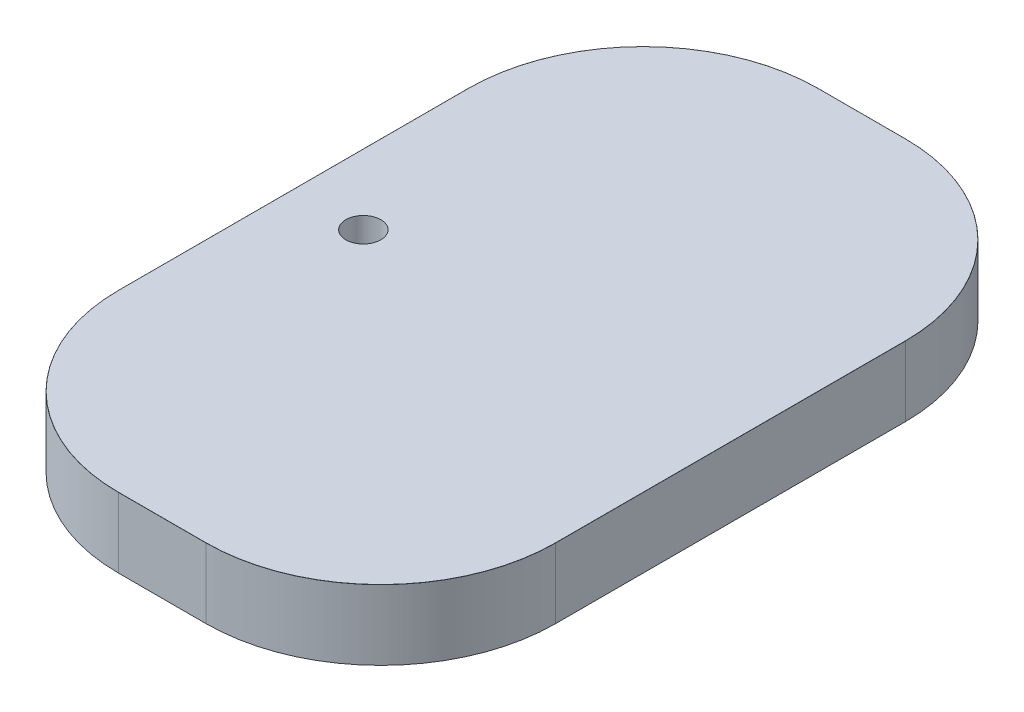
ISO-10303-21;
HEADER;
FILE_DESCRIPTION(('STEP AP214'),'2;1');
FILE_NAME('part.step','',(''),(''),'','','');
FILE_SCHEMA(('AUTOMOTIVE_DESIGN { 1 0 10303 214 1 1 1 1 }'));
ENDSEC;
DATA;
#1=APPLICATION_CONTEXT('core data for automotive mechanical design processes');
#2=APPLICATION_PROTOCOL_DEFINITION('international standard','automotive_design',2000,#1);
#3=PRODUCT_CONTEXT('',#1,'mechanical');
#4=PRODUCT('Part','Part','',(#3));
#5=PRODUCT_RELATED_PRODUCT_CATEGORY('part','',(#4));
#6=PRODUCT_DEFINITION_FORMATION('','',#4);
#7=PRODUCT_DEFINITION_CONTEXT('part definition',#1,'design');
#8=PRODUCT_DEFINITION('design','',#6,#7);
#9=PRODUCT_DEFINITION_SHAPE('','',#8);
#10=(LENGTH_UNIT() NAMED_UNIT(*) SI_UNIT(.MILLI.,.METRE.));
#11=(NAMED_UNIT(*) PLANE_ANGLE_UNIT() SI_UNIT($,.RADIAN.));
#12=(NAMED_UNIT(*) SI_UNIT($,.STERADIAN.) SOLID_ANGLE_UNIT());
#13=UNCERTAINTY_MEASURE_WITH_UNIT(LENGTH_MEASURE(1.E-05),#10,'distance_accuracy_value','');
#14=(GEOMETRIC_REPRESENTATION_CONTEXT(3) GLOBAL_UNCERTAINTY_ASSIGNED_CONTEXT((#13)) GLOBAL_UNIT_ASSIGNED_CONTEXT((#10,
#11,#12)) REPRESENTATION_CONTEXT('',''));
#15=CARTESIAN_POINT('',(0.,0.,0.));
#16=DIRECTION('',(0.,0.,1.));
#17=DIRECTION('',(1.,0.,0.));
#18=AXIS2_PLACEMENT_3D('',#15,#16,#17);
#19=CARTESIAN_POINT('',(-5.,8.,-20.));
#20=DIRECTION('',(0.,-1.,0.));
#21=DIRECTION('',(0.,0.,-1.));
#22=AXIS2_PLACEMENT_3D('',#19,#20,#21);
#23=CYLINDRICAL_SURFACE('',#22,20.);
#24=DIRECTION('',(0.,-1.,0.));
#25=VECTOR('',#24,1.);
#26=CARTESIAN_POINT('',(-25.,8.,-20.));
#27=LINE('',#26,#25);
#28=CARTESIAN_POINT('',(-25.,7.99,-20.));
#29=VERTEX_POINT('',#28);
#30=CARTESIAN_POINT('',(-25.,0.,-20.));
#31=VERTEX_POINT('',#30);
#32=EDGE_CURVE('E138',#29,#31,#27,.T.);
#33=ORIENTED_EDGE('',*,*,#32,.F.);
#34=CARTESIAN_POINT('',(-5.,7.99,-20.));
#35=DIRECTION('',(0.,-1.,0.));
#36=DIRECTION('',(0.,0.,-1.));
#37=AXIS2_PLACEMENT_3D('',#34,#35,#36);
#38=CIRCLE('',#37,20.);
#39=CARTESIAN_POINT('',(-5.,7.99,-40.));
#40=VERTEX_POINT('',#39);
#41=EDGE_CURVE('E239',#29,#40,#38,.T.);
#42=ORIENTED_EDGE('',*,*,#41,.T.);
#43=DIRECTION('',(0.,-1.,0.));
#44=VECTOR('',#43,1.);
#45=CARTESIAN_POINT('',(-5.,8.,-40.));
#46=LINE('',#45,#44);
#47=CARTESIAN_POINT('',(-5.,0.,-40.));
#48=VERTEX_POINT('',#47);
#49=EDGE_CURVE('E163',#40,#48,#46,.T.);
#50=ORIENTED_EDGE('',*,*,#49,.T.);
#51=CARTESIAN_POINT('',(-5.,0.,-20.));
#52=DIRECTION('',(0.,1.,0.));
#53=DIRECTION('',(0.,0.,-1.));
#54=AXIS2_PLACEMENT_3D('',#51,#52,#53);
#55=CIRCLE('',#54,20.);
#56=EDGE_CURVE('E156',#48,#31,#55,.T.);
#57=ORIENTED_EDGE('',*,*,#56,.T.);
#58=EDGE_LOOP('',(#33,#42,#50,#57));
#59=FACE_BOUND('',#58,.T.);
#60=ADVANCED_FACE('F47',(#59),#23,.T.);
#61=CARTESIAN_POINT('',(-25.,8.,20.));
#62=DIRECTION('',(1.,0.,0.));
#63=DIRECTION('',(0.,0.,-1.));
#64=AXIS2_PLACEMENT_3D('',#61,#62,#63);
#65=PLANE('',#64);
#66=DIRECTION('',(0.,-1.,0.));
#67=VECTOR('',#66,1.);
#68=CARTESIAN_POINT('',(-25.,8.,20.));
#69=LINE('',#68,#67);
#70=CARTESIAN_POINT('',(-25.,7.99,20.));
#71=VERTEX_POINT('',#70);
#72=CARTESIAN_POINT('',(-25.,0.,20.));
#73=VERTEX_POINT('',#72);
#74=EDGE_CURVE('E150',#71,#73,#69,.T.);
#75=ORIENTED_EDGE('',*,*,#74,.F.);
#76=DIRECTION('',(0.,0.,1.));
#77=VECTOR('',#76,1.);
#78=CARTESIAN_POINT('',(-25.,7.99,20.));
#79=LINE('',#78,#77);
#80=EDGE_CURVE('E11',#71,#29,#79,.F.);
#81=ORIENTED_EDGE('',*,*,#80,.T.);
#82=ORIENTED_EDGE('',*,*,#32,.T.);
#83=DIRECTION('',(0.,0.,1.));
#84=VECTOR('',#83,1.);
#85=CARTESIAN_POINT('',(-25.,0.,20.));
#86=LINE('',#85,#84);
#87=EDGE_CURVE('E141',#31,#73,#86,.T.);
#88=ORIENTED_EDGE('',*,*,#87,.T.);
#89=EDGE_LOOP('',(#75,#81,#82,#88));
#90=FACE_BOUND('',#89,.T.);
#91=ADVANCED_FACE('F140',(#90),#65,.F.);
#92=CARTESIAN_POINT('',(-5.,8.,20.));
#93=DIRECTION('',(0.,-1.,0.));
#94=DIRECTION('',(0.,0.,-1.));
#95=AXIS2_PLACEMENT_3D('',#92,#93,#94);
#96=CYLINDRICAL_SURFACE('',#95,20.);
#97=DIRECTION('',(0.,-1.,0.));
#98=VECTOR('',#97,1.);
#99=CARTESIAN_POINT('',(-5.,8.,40.));
#100=LINE('',#99,#98);
#101=CARTESIAN_POINT('',(-5.,7.99,40.));
#102=VERTEX_POINT('',#101);
#103=CARTESIAN_POINT('',(-5.,0.,40.));
#104=VERTEX_POINT('',#103);
#105=EDGE_CURVE('E210',#102,#104,#100,.T.);
#106=ORIENTED_EDGE('',*,*,#105,.F.);
#107=CARTESIAN_POINT('',(-5.,7.99,20.));
#108=DIRECTION('',(0.,-1.,0.));
#109=DIRECTION('',(0.,0.,-1.));
#110=AXIS2_PLACEMENT_3D('',#107,#108,#109);
#111=CIRCLE('',#110,20.);
#112=EDGE_CURVE('E57',#102,#71,#111,.T.);
#113=ORIENTED_EDGE('',*,*,#112,.T.);
#114=ORIENTED_EDGE('',*,*,#74,.T.);
#115=CARTESIAN_POINT('',(-5.,0.,20.));
#116=DIRECTION('',(0.,1.,0.));
#117=DIRECTION('',(0.,0.,-1.));
#118=AXIS2_PLACEMENT_3D('',#115,#116,#117);
#119=CIRCLE('',#118,20.);
#120=EDGE_CURVE('E159',#73,#104,#119,.T.);
#121=ORIENTED_EDGE('',*,*,#120,.T.);
#122=EDGE_LOOP('',(#106,#113,#114,#121));
#123=FACE_BOUND('',#122,.T.);
#124=ADVANCED_FACE('F326',(#123),#96,.T.);
#125=CARTESIAN_POINT('',(-5.,8.,40.));
#126=DIRECTION('',(0.,0.,-1.));
#127=DIRECTION('',(-1.,0.,0.));
#128=AXIS2_PLACEMENT_3D('',#125,#126,#127);
#129=PLANE('',#128);
#130=DIRECTION('',(0.,-1.,0.));
#131=VECTOR('',#130,1.);
#132=CARTESIAN_POINT('',(5.,8.,40.));
#133=LINE('',#132,#131);
#134=CARTESIAN_POINT('',(5.,7.99,40.));
#135=VERTEX_POINT('',#134);
#136=CARTESIAN_POINT('',(5.,0.,40.));
#137=VERTEX_POINT('',#136);
#138=EDGE_CURVE('E207',#135,#137,#133,.T.);
#139=ORIENTED_EDGE('',*,*,#138,.F.);
#140=DIRECTION('',(1.,0.,0.));
#141=VECTOR('',#140,1.);
#142=CARTESIAN_POINT('',(-5.,7.99,40.));
#143=LINE('',#142,#141);
#144=EDGE_CURVE('E72',#135,#102,#143,.F.);
#145=ORIENTED_EDGE('',*,*,#144,.T.);
#146=ORIENTED_EDGE('',*,*,#105,.T.);
#147=DIRECTION('',(1.,0.,0.));
#148=VECTOR('',#147,1.);
#149=CARTESIAN_POINT('',(-5.,0.,40.));
#150=LINE('',#149,#148);
#151=EDGE_CURVE('E177',#104,#137,#150,.T.);
#152=ORIENTED_EDGE('',*,*,#151,.T.);
#153=EDGE_LOOP('',(#139,#145,#146,#152));
#154=FACE_BOUND('',#153,.T.);
#155=ADVANCED_FACE('F325',(#154),#129,.F.);
#156=CARTESIAN_POINT('',(5.,8.,20.));
#157=DIRECTION('',(0.,-1.,0.));
#158=DIRECTION('',(0.,0.,-1.));
#159=AXIS2_PLACEMENT_3D('',#156,#157,#158);
#160=CYLINDRICAL_SURFACE('',#159,20.);
#161=DIRECTION('',(0.,-1.,0.));
#162=VECTOR('',#161,1.);
#163=CARTESIAN_POINT('',(25.,8.,20.));
#164=LINE('',#163,#162);
#165=CARTESIAN_POINT('',(25.,7.99,20.));
#166=VERTEX_POINT('',#165);
#167=CARTESIAN_POINT('',(25.,0.,20.));
#168=VERTEX_POINT('',#167);
#169=EDGE_CURVE('E204',#166,#168,#164,.T.);
#170=ORIENTED_EDGE('',*,*,#169,.F.);
#171=CARTESIAN_POINT('',(5.,7.99,20.));
#172=DIRECTION('',(0.,-1.,0.));
#173=DIRECTION('',(0.,0.,-1.));
#174=AXIS2_PLACEMENT_3D('',#171,#172,#173);
#175=CIRCLE('',#174,20.);
#176=EDGE_CURVE('E251',#166,#135,#175,.T.);
#177=ORIENTED_EDGE('',*,*,#176,.T.);
#178=ORIENTED_EDGE('',*,*,#138,.T.);
#179=CARTESIAN_POINT('',(5.,0.,20.));
#180=DIRECTION('',(0.,1.,0.));
#181=DIRECTION('',(0.,0.,-1.));
#182=AXIS2_PLACEMENT_3D('',#179,#180,#181);
#183=CIRCLE('',#182,20.);
#184=EDGE_CURVE('E181',#137,#168,#183,.T.);
#185=ORIENTED_EDGE('',*,*,#184,.T.);
#186=EDGE_LOOP('',(#170,#177,#178,#185));
#187=FACE_BOUND('',#186,.T.);
#188=ADVANCED_FACE('F324',(#187),#160,.T.);
#189=CARTESIAN_POINT('',(25.,8.,-20.));
#190=DIRECTION('',(-1.,0.,0.));
#191=DIRECTION('',(0.,0.,1.));
#192=AXIS2_PLACEMENT_3D('',#189,#190,#191);
#193=PLANE('',#192);
#194=DIRECTION('',(0.,-1.,0.));
#195=VECTOR('',#194,1.);
#196=CARTESIAN_POINT('',(25.,8.,-20.));
#197=LINE('',#196,#195);
#198=CARTESIAN_POINT('',(25.,7.99,-20.));
#199=VERTEX_POINT('',#198);
#200=CARTESIAN_POINT('',(25.,0.,-20.));
#201=VERTEX_POINT('',#200);
#202=EDGE_CURVE('E201',#199,#201,#197,.T.);
#203=ORIENTED_EDGE('',*,*,#202,.F.);
#204=DIRECTION('',(0.,0.,-1.));
#205=VECTOR('',#204,1.);
#206=CARTESIAN_POINT('',(25.,7.99,-20.));
#207=LINE('',#206,#205);
#208=EDGE_CURVE('E248',#199,#166,#207,.F.);
#209=ORIENTED_EDGE('',*,*,#208,.T.);
#210=ORIENTED_EDGE('',*,*,#169,.T.);
#211=DIRECTION('',(0.,0.,-1.));
#212=VECTOR('',#211,1.);
#213=CARTESIAN_POINT('',(25.,0.,-20.));
#214=LINE('',#213,#212);
#215=EDGE_CURVE('E185',#168,#201,#214,.T.);
#216=ORIENTED_EDGE('',*,*,#215,.T.);
#217=EDGE_LOOP('',(#203,#209,#210,#216));
#218=FACE_BOUND('',#217,.T.);
#219=ADVANCED_FACE('F321',(#218),#193,.F.);
#220=CARTESIAN_POINT('',(5.,8.,-20.));
#221=DIRECTION('',(0.,-1.,0.));
#222=DIRECTION('',(0.,0.,-1.));
#223=AXIS2_PLACEMENT_3D('',#220,#221,#222);
#224=CYLINDRICAL_SURFACE('',#223,20.);
#225=DIRECTION('',(0.,-1.,0.));
#226=VECTOR('',#225,1.);
#227=CARTESIAN_POINT('',(5.,8.,-40.));
#228=LINE('',#227,#226);
#229=CARTESIAN_POINT('',(5.,7.99,-40.));
#230=VERTEX_POINT('',#229);
#231=CARTESIAN_POINT('',(5.,0.,-40.));
#232=VERTEX_POINT('',#231);
#233=EDGE_CURVE('E198',#230,#232,#228,.T.);
#234=ORIENTED_EDGE('',*,*,#233,.F.);
#235=CARTESIAN_POINT('',(5.,7.99,-20.));
#236=DIRECTION('',(0.,-1.,0.));
#237=DIRECTION('',(0.,0.,-1.));
#238=AXIS2_PLACEMENT_3D('',#235,#236,#237);
#239=CIRCLE('',#238,20.);
#240=EDGE_CURVE('E245',#230,#199,#239,.T.);
#241=ORIENTED_EDGE('',*,*,#240,.T.);
#242=ORIENTED_EDGE('',*,*,#202,.T.);
#243=CARTESIAN_POINT('',(5.,0.,-20.));
#244=DIRECTION('',(0.,1.,0.));
#245=DIRECTION('',(0.,0.,-1.));
#246=AXIS2_PLACEMENT_3D('',#243,#244,#245);
#247=CIRCLE('',#246,20.);
#248=EDGE_CURVE('E189',#201,#232,#247,.T.);
#249=ORIENTED_EDGE('',*,*,#248,.T.);
#250=EDGE_LOOP('',(#234,#241,#242,#249));
#251=FACE_BOUND('',#250,.T.);
#252=ADVANCED_FACE('F316',(#251),#224,.T.);
#253=CARTESIAN_POINT('',(-5.,8.,-40.));
#254=DIRECTION('',(0.,0.,1.));
#255=DIRECTION('',(1.,0.,0.));
#256=AXIS2_PLACEMENT_3D('',#253,#254,#255);
#257=PLANE('',#256);
#258=ORIENTED_EDGE('',*,*,#49,.F.);
#259=DIRECTION('',(-1.,0.,0.));
#260=VECTOR('',#259,1.);
#261=CARTESIAN_POINT('',(-5.,7.99,-40.));
#262=LINE('',#261,#260);
#263=EDGE_CURVE('E242',#40,#230,#262,.F.);
#264=ORIENTED_EDGE('',*,*,#263,.T.);
#265=ORIENTED_EDGE('',*,*,#233,.T.);
#266=DIRECTION('',(-1.,0.,0.));
#267=VECTOR('',#266,1.);
#268=CARTESIAN_POINT('',(-5.,0.,-40.));
#269=LINE('',#268,#267);
#270=EDGE_CURVE('E193',#232,#48,#269,.T.);
#271=ORIENTED_EDGE('',*,*,#270,.T.);
#272=EDGE_LOOP('',(#258,#264,#265,#271));
#273=FACE_BOUND('',#272,.T.);
#274=ADVANCED_FACE('F310',(#273),#257,.F.);
#275=CARTESIAN_POINT('',(-5.,8.,-20.));
#276=DIRECTION('',(0.,-1.,0.));
#277=DIRECTION('',(0.,0.,-1.));
#278=AXIS2_PLACEMENT_3D('',#275,#276,#277);
#279=PLANE('',#278);
#280=CARTESIAN_POINT('',(-17.,8.,0.));
#281=DIRECTION('',(0.,1.,0.));
#282=DIRECTION('',(0.,0.,1.));
#283=AXIS2_PLACEMENT_3D('',#280,#281,#282);
#284=CIRCLE('',#283,2.);
#285=CARTESIAN_POINT('',(-17.,8.,2.));
#286=VERTEX_POINT('',#285);
#287=EDGE_CURVE('E172',#286,#286,#284,.T.);
#288=ORIENTED_EDGE('',*,*,#287,.F.);
#289=EDGE_LOOP('',(#288));
#290=FACE_BOUND('',#289,.T.);
#291=DIRECTION('',(-1.,0.,0.));
#292=VECTOR('',#291,1.);
#293=CARTESIAN_POINT('',(-5.,8.,-39.99));
#294=LINE('',#293,#292);
#295=CARTESIAN_POINT('',(5.,8.,-39.99));
#296=VERTEX_POINT('',#295);
#297=CARTESIAN_POINT('',(-5.,8.,-39.99));
#298=VERTEX_POINT('',#297);
#299=EDGE_CURVE('E232',#296,#298,#294,.T.);
#300=ORIENTED_EDGE('',*,*,#299,.T.);
#301=CARTESIAN_POINT('',(-5.,8.,-20.));
#302=DIRECTION('',(0.,-1.,0.));
#303=DIRECTION('',(0.,0.,-1.));
#304=AXIS2_PLACEMENT_3D('',#301,#302,#303);
#305=CIRCLE('',#304,19.99);
#306=CARTESIAN_POINT('',(-24.99,8.,-20.));
#307=VERTEX_POINT('',#306);
#308=EDGE_CURVE('E235',#298,#307,#305,.F.);
#309=ORIENTED_EDGE('',*,*,#308,.T.);
#310=DIRECTION('',(0.,0.,1.));
#311=VECTOR('',#310,1.);
#312=CARTESIAN_POINT('',(-24.99,8.,-20.));
#313=LINE('',#312,#311);
#314=CARTESIAN_POINT('',(-24.99,8.,20.));
#315=VERTEX_POINT('',#314);
#316=EDGE_CURVE('E149',#307,#315,#313,.T.);
#317=ORIENTED_EDGE('',*,*,#316,.T.);
#318=CARTESIAN_POINT('',(-5.,8.,20.));
#319=DIRECTION('',(0.,-1.,0.));
#320=DIRECTION('',(0.,0.,-1.));
#321=AXIS2_PLACEMENT_3D('',#318,#319,#320);
#322=CIRCLE('',#321,19.99);
#323=CARTESIAN_POINT('',(-5.,8.,39.99));
#324=VERTEX_POINT('',#323);
#325=EDGE_CURVE('E217',#315,#324,#322,.F.);
#326=ORIENTED_EDGE('',*,*,#325,.T.);
#327=DIRECTION('',(1.,0.,0.));
#328=VECTOR('',#327,1.);
#329=CARTESIAN_POINT('',(-5.,8.,39.99));
#330=LINE('',#329,#328);
#331=CARTESIAN_POINT('',(5.,8.,39.99));
#332=VERTEX_POINT('',#331);
#333=EDGE_CURVE('E220',#324,#332,#330,.T.);
#334=ORIENTED_EDGE('',*,*,#333,.T.);
#335=CARTESIAN_POINT('',(5.,8.,20.));
#336=DIRECTION('',(0.,-1.,0.));
#337=DIRECTION('',(0.,0.,-1.));
#338=AXIS2_PLACEMENT_3D('',#335,#336,#337);
#339=CIRCLE('',#338,19.99);
#340=CARTESIAN_POINT('',(24.99,8.,20.));
#341=VERTEX_POINT('',#340);
#342=EDGE_CURVE('E223',#332,#341,#339,.F.);
#343=ORIENTED_EDGE('',*,*,#342,.T.);
#344=DIRECTION('',(0.,0.,-1.));
#345=VECTOR('',#344,1.);
#346=CARTESIAN_POINT('',(24.99,8.,-20.));
#347=LINE('',#346,#345);
#348=CARTESIAN_POINT('',(24.99,8.,-20.));
#349=VERTEX_POINT('',#348);
#350=EDGE_CURVE('E226',#341,#349,#347,.T.);
#351=ORIENTED_EDGE('',*,*,#350,.T.);
#352=CARTESIAN_POINT('',(5.,8.,-20.));
#353=DIRECTION('',(0.,-1.,0.));
#354=DIRECTION('',(0.,0.,-1.));
#355=AXIS2_PLACEMENT_3D('',#352,#353,#354);
#356=CIRCLE('',#355,19.99);
#357=EDGE_CURVE('E229',#349,#296,#356,.F.);
#358=ORIENTED_EDGE('',*,*,#357,.T.);
#359=EDGE_LOOP('',(#300,#309,#317,#326,#334,#343,#351,#358));
#360=FACE_BOUND('',#359,.T.);
#361=ADVANCED_FACE('F294',(#290,#360),#279,.F.);
#362=CARTESIAN_POINT('',(-5.,0.,-20.));
#363=DIRECTION('',(0.,-1.,0.));
#364=DIRECTION('',(0.,0.,-1.));
#365=AXIS2_PLACEMENT_3D('',#362,#363,#364);
#366=PLANE('',#365);
#367=CARTESIAN_POINT('',(-17.,0.,0.));
#368=DIRECTION('',(0.,-1.,0.));
#369=DIRECTION('',(0.,0.,-1.));
#370=AXIS2_PLACEMENT_3D('',#367,#368,#369);
#371=CIRCLE('',#370,1.25);
#372=CARTESIAN_POINT('',(-17.,0.,-1.25));
#373=VERTEX_POINT('',#372);
#374=EDGE_CURVE('E492',#373,#373,#371,.T.);
#375=ORIENTED_EDGE('',*,*,#374,.F.);
#376=EDGE_LOOP('',(#375));
#377=FACE_BOUND('',#376,.T.);
#378=ORIENTED_EDGE('',*,*,#56,.F.);
#379=ORIENTED_EDGE('',*,*,#270,.F.);
#380=ORIENTED_EDGE('',*,*,#248,.F.);
#381=ORIENTED_EDGE('',*,*,#215,.F.);
#382=ORIENTED_EDGE('',*,*,#184,.F.);
#383=ORIENTED_EDGE('',*,*,#151,.F.);
#384=ORIENTED_EDGE('',*,*,#120,.F.);
#385=ORIENTED_EDGE('',*,*,#87,.F.);
#386=EDGE_LOOP('',(#378,#379,#380,#381,#382,#383,#384,#385));
#387=FACE_BOUND('',#386,.T.);
#388=ADVANCED_FACE('F154',(#377,#387),#366,.T.);
#389=CARTESIAN_POINT('',(5.,7.99,20.));
#390=DIRECTION('',(0.,-1.,0.));
#391=DIRECTION('',(0.,0.,-1.));
#392=AXIS2_PLACEMENT_3D('',#389,#390,#391);
#393=TOROIDAL_SURFACE('',#392,19.99,0.01);
#394=CARTESIAN_POINT('',(5.,7.99,39.99));
#395=DIRECTION('',(-1.,0.,0.));
#396=DIRECTION('',(0.,0.,1.));
#397=AXIS2_PLACEMENT_3D('',#394,#395,#396);
#398=CIRCLE('',#397,0.01);
#399=EDGE_CURVE('E170',#135,#332,#398,.T.);
#400=ORIENTED_EDGE('',*,*,#399,.F.);
#401=ORIENTED_EDGE('',*,*,#176,.F.);
#402=CARTESIAN_POINT('',(24.99,7.99,20.));
#403=DIRECTION('',(0.,0.,-1.));
#404=DIRECTION('',(-1.,0.,0.));
#405=AXIS2_PLACEMENT_3D('',#402,#403,#404);
#406=CIRCLE('',#405,0.01);
#407=EDGE_CURVE('E166',#341,#166,#406,.T.);
#408=ORIENTED_EDGE('',*,*,#407,.F.);
#409=ORIENTED_EDGE('',*,*,#342,.F.);
#410=EDGE_LOOP('',(#400,#401,#408,#409));
#411=FACE_BOUND('',#410,.T.);
#412=ADVANCED_FACE('F49',(#411),#393,.T.);
#413=CARTESIAN_POINT('',(24.99,7.99,-20.));
#414=DIRECTION('',(0.,0.,-1.));
#415=DIRECTION('',(-1.,0.,0.));
#416=AXIS2_PLACEMENT_3D('',#413,#414,#415);
#417=CYLINDRICAL_SURFACE('',#416,0.01);
#418=ORIENTED_EDGE('',*,*,#407,.T.);
#419=ORIENTED_EDGE('',*,*,#208,.F.);
#420=CARTESIAN_POINT('',(24.99,7.99,-20.));
#421=DIRECTION('',(0.,0.,-1.));
#422=DIRECTION('',(-1.,0.,0.));
#423=AXIS2_PLACEMENT_3D('',#420,#421,#422);
#424=CIRCLE('',#423,0.01);
#425=EDGE_CURVE('E277',#349,#199,#424,.T.);
#426=ORIENTED_EDGE('',*,*,#425,.F.);
#427=ORIENTED_EDGE('',*,*,#350,.F.);
#428=EDGE_LOOP('',(#418,#419,#426,#427));
#429=FACE_BOUND('',#428,.T.);
#430=ADVANCED_FACE('F356',(#429),#417,.T.);
#431=CARTESIAN_POINT('',(-5.,7.99,39.99));
#432=DIRECTION('',(1.,0.,0.));
#433=DIRECTION('',(0.,0.,-1.));
#434=AXIS2_PLACEMENT_3D('',#431,#432,#433);
#435=CYLINDRICAL_SURFACE('',#434,0.01);
#436=ORIENTED_EDGE('',*,*,#399,.T.);
#437=ORIENTED_EDGE('',*,*,#333,.F.);
#438=CARTESIAN_POINT('',(-5.,7.99,39.99));
#439=DIRECTION('',(-1.,0.,0.));
#440=DIRECTION('',(0.,0.,1.));
#441=AXIS2_PLACEMENT_3D('',#438,#439,#440);
#442=CIRCLE('',#441,0.01);
#443=EDGE_CURVE('E273',#102,#324,#442,.T.);
#444=ORIENTED_EDGE('',*,*,#443,.F.);
#445=ORIENTED_EDGE('',*,*,#144,.F.);
#446=EDGE_LOOP('',(#436,#437,#444,#445));
#447=FACE_BOUND('',#446,.T.);
#448=ADVANCED_FACE('F286',(#447),#435,.T.);
#449=CARTESIAN_POINT('',(5.,7.99,-20.));
#450=DIRECTION('',(0.,-1.,0.));
#451=DIRECTION('',(0.,0.,-1.));
#452=AXIS2_PLACEMENT_3D('',#449,#450,#451);
#453=TOROIDAL_SURFACE('',#452,19.99,0.01);
#454=ORIENTED_EDGE('',*,*,#425,.T.);
#455=ORIENTED_EDGE('',*,*,#240,.F.);
#456=CARTESIAN_POINT('',(5.,7.99,-39.99));
#457=DIRECTION('',(-1.,0.,0.));
#458=DIRECTION('',(0.,0.,1.));
#459=AXIS2_PLACEMENT_3D('',#456,#457,#458);
#460=CIRCLE('',#459,0.01);
#461=EDGE_CURVE('E269',#296,#230,#460,.T.);
#462=ORIENTED_EDGE('',*,*,#461,.F.);
#463=ORIENTED_EDGE('',*,*,#357,.F.);
#464=EDGE_LOOP('',(#454,#455,#462,#463));
#465=FACE_BOUND('',#464,.T.);
#466=ADVANCED_FACE('F351',(#465),#453,.T.);
#467=CARTESIAN_POINT('',(-5.,7.99,20.));
#468=DIRECTION('',(0.,-1.,0.));
#469=DIRECTION('',(0.,0.,-1.));
#470=AXIS2_PLACEMENT_3D('',#467,#468,#469);
#471=TOROIDAL_SURFACE('',#470,19.99,0.01);
#472=ORIENTED_EDGE('',*,*,#443,.T.);
#473=ORIENTED_EDGE('',*,*,#325,.F.);
#474=CARTESIAN_POINT('',(-24.99,7.99,20.));
#475=DIRECTION('',(0.,0.,-1.));
#476=DIRECTION('',(-1.,0.,0.));
#477=AXIS2_PLACEMENT_3D('',#474,#475,#476);
#478=CIRCLE('',#477,0.01);
#479=EDGE_CURVE('E265',#71,#315,#478,.T.);
#480=ORIENTED_EDGE('',*,*,#479,.F.);
#481=ORIENTED_EDGE('',*,*,#112,.F.);
#482=EDGE_LOOP('',(#472,#473,#480,#481));
#483=FACE_BOUND('',#482,.T.);
#484=ADVANCED_FACE('F300',(#483),#471,.T.);
#485=CARTESIAN_POINT('',(-5.,7.99,-39.99));
#486=DIRECTION('',(-1.,0.,0.));
#487=DIRECTION('',(0.,0.,1.));
#488=AXIS2_PLACEMENT_3D('',#485,#486,#487);
#489=CYLINDRICAL_SURFACE('',#488,0.01);
#490=ORIENTED_EDGE('',*,*,#461,.T.);
#491=ORIENTED_EDGE('',*,*,#263,.F.);
#492=CARTESIAN_POINT('',(-5.,7.99,-39.99));
#493=DIRECTION('',(-1.,0.,0.));
#494=DIRECTION('',(0.,0.,1.));
#495=AXIS2_PLACEMENT_3D('',#492,#493,#494);
#496=CIRCLE('',#495,0.01);
#497=EDGE_CURVE('E261',#298,#40,#496,.T.);
#498=ORIENTED_EDGE('',*,*,#497,.F.);
#499=ORIENTED_EDGE('',*,*,#299,.F.);
#500=EDGE_LOOP('',(#490,#491,#498,#499));
#501=FACE_BOUND('',#500,.T.);
#502=ADVANCED_FACE('F345',(#501),#489,.T.);
#503=CARTESIAN_POINT('',(-24.99,7.99,-20.));
#504=DIRECTION('',(0.,0.,1.));
#505=DIRECTION('',(1.,0.,0.));
#506=AXIS2_PLACEMENT_3D('',#503,#504,#505);
#507=CYLINDRICAL_SURFACE('',#506,0.01);
#508=ORIENTED_EDGE('',*,*,#479,.T.);
#509=ORIENTED_EDGE('',*,*,#316,.F.);
#510=CARTESIAN_POINT('',(-24.99,7.99,-20.));
#511=DIRECTION('',(0.,0.,-1.));
#512=DIRECTION('',(-1.,0.,0.));
#513=AXIS2_PLACEMENT_3D('',#510,#511,#512);
#514=CIRCLE('',#513,0.01);
#515=EDGE_CURVE('E258',#29,#307,#514,.T.);
#516=ORIENTED_EDGE('',*,*,#515,.F.);
#517=ORIENTED_EDGE('',*,*,#80,.F.);
#518=EDGE_LOOP('',(#508,#509,#516,#517));
#519=FACE_BOUND('',#518,.T.);
#520=ADVANCED_FACE('F302',(#519),#507,.T.);
#521=CARTESIAN_POINT('',(-5.,7.99,-20.));
#522=DIRECTION('',(0.,-1.,0.));
#523=DIRECTION('',(0.,0.,-1.));
#524=AXIS2_PLACEMENT_3D('',#521,#522,#523);
#525=TOROIDAL_SURFACE('',#524,19.99,0.01);
#526=ORIENTED_EDGE('',*,*,#497,.T.);
#527=ORIENTED_EDGE('',*,*,#41,.F.);
#528=ORIENTED_EDGE('',*,*,#515,.T.);
#529=ORIENTED_EDGE('',*,*,#308,.F.);
#530=EDGE_LOOP('',(#526,#527,#528,#529));
#531=FACE_BOUND('',#530,.T.);
#532=ADVANCED_FACE('F306',(#531),#525,.T.);
#533=CARTESIAN_POINT('',(-17.,2.,0.));
#534=DIRECTION('',(0.,1.,0.));
#535=DIRECTION('',(0.,0.,1.));
#536=AXIS2_PLACEMENT_3D('',#533,#534,#535);
#537=CYLINDRICAL_SURFACE('',#536,2.);
#538=CARTESIAN_POINT('',(-17.,2.,0.));
#539=DIRECTION('',(0.,1.,0.));
#540=DIRECTION('',(0.,0.,1.));
#541=AXIS2_PLACEMENT_3D('',#538,#539,#540);
#542=CIRCLE('',#541,2.);
#543=CARTESIAN_POINT('',(-17.,2.,2.));
#544=VERTEX_POINT('',#543);
#545=EDGE_CURVE('E262',#544,#544,#542,.T.);
#546=ORIENTED_EDGE('',*,*,#545,.F.);
#547=EDGE_LOOP('',(#546));
#548=FACE_BOUND('',#547,.T.);
#549=ORIENTED_EDGE('',*,*,#287,.T.);
#550=EDGE_LOOP('',(#549));
#551=FACE_BOUND('',#550,.T.);
#552=ADVANCED_FACE('F342',(#548,#551),#537,.F.);
#553=CARTESIAN_POINT('',(-17.,2.,0.));
#554=DIRECTION('',(0.,1.,0.));
#555=DIRECTION('',(0.,0.,1.));
#556=AXIS2_PLACEMENT_3D('',#553,#554,#555);
#557=PLANE('',#556);
#558=CARTESIAN_POINT('',(-17.,2.,0.));
#559=DIRECTION('',(0.,1.,0.));
#560=DIRECTION('',(0.,0.,1.));
#561=AXIS2_PLACEMENT_3D('',#558,#559,#560);
#562=CIRCLE('',#561,1.25);
#563=CARTESIAN_POINT('',(-17.,2.,1.25));
#564=VERTEX_POINT('',#563);
#565=EDGE_CURVE('E51',#564,#564,#562,.T.);
#566=ORIENTED_EDGE('',*,*,#565,.F.);
#567=EDGE_LOOP('',(#566));
#568=FACE_BOUND('',#567,.T.);
#569=ORIENTED_EDGE('',*,*,#545,.T.);
#570=EDGE_LOOP('',(#569));
#571=FACE_BOUND('',#570,.T.);
#572=ADVANCED_FACE('F469',(#568,#571),#557,.T.);
#573=CARTESIAN_POINT('',(-17.,-2.,0.));
#574=DIRECTION('',(0.,1.,0.));
#575=DIRECTION('',(0.,0.,1.));
#576=AXIS2_PLACEMENT_3D('',#573,#574,#575);
#577=CYLINDRICAL_SURFACE('',#576,1.25);
#578=ORIENTED_EDGE('',*,*,#374,.T.);
#579=EDGE_LOOP('',(#578));
#580=FACE_BOUND('',#579,.T.);
#581=ORIENTED_EDGE('',*,*,#565,.T.);
#582=EDGE_LOOP('',(#581));
#583=FACE_BOUND('',#582,.T.);
#584=ADVANCED_FACE('F477',(#580,#583),#577,.F.);
#585=CLOSED_SHELL('',(#60,#91,#124,#155,#188,#219,#252,#274,#361,#388,#412,#430,#448,#466,#484,
#502,#520,#532,#552,#572,#584));
#586=MANIFOLD_SOLID_BREP('B2',#585);
#587=ADVANCED_BREP_SHAPE_REPRESENTATION('',(#18,#586),#14);
#588=SHAPE_DEFINITION_REPRESENTATION(#9,#587);
ENDSEC;
END-ISO-10303-21;
